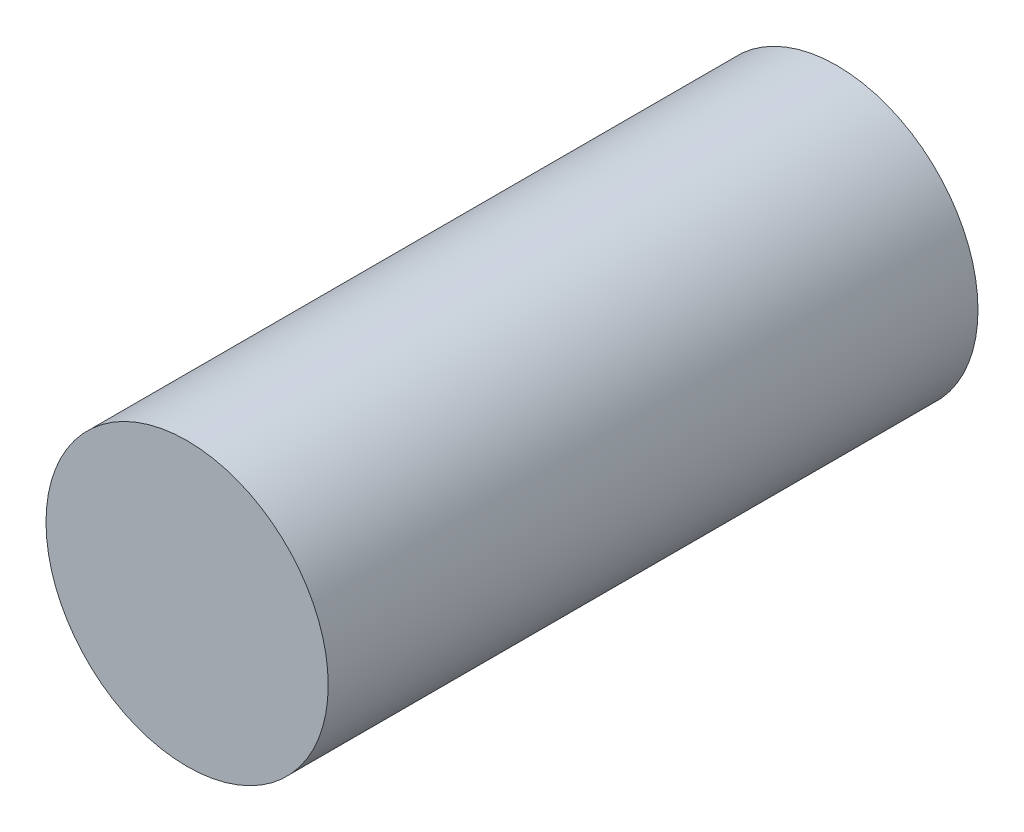
ISO-10303-21;
HEADER;
FILE_DESCRIPTION(('STEP AP214'),'2;1');
FILE_NAME('part.step','',(''),(''),'','','');
FILE_SCHEMA(('AUTOMOTIVE_DESIGN { 1 0 10303 214 1 1 1 1 }'));
ENDSEC;
DATA;
#1=APPLICATION_CONTEXT('core data for automotive mechanical design processes');
#2=APPLICATION_PROTOCOL_DEFINITION('international standard','automotive_design',2000,#1);
#3=PRODUCT_CONTEXT('',#1,'mechanical');
#4=PRODUCT('Part','Part','',(#3));
#5=PRODUCT_RELATED_PRODUCT_CATEGORY('part','',(#4));
#6=PRODUCT_DEFINITION_FORMATION('','',#4);
#7=PRODUCT_DEFINITION_CONTEXT('part definition',#1,'design');
#8=PRODUCT_DEFINITION('design','',#6,#7);
#9=PRODUCT_DEFINITION_SHAPE('','',#8);
#10=(LENGTH_UNIT() NAMED_UNIT(*) SI_UNIT(.MILLI.,.METRE.));
#11=(NAMED_UNIT(*) PLANE_ANGLE_UNIT() SI_UNIT($,.RADIAN.));
#12=(NAMED_UNIT(*) SI_UNIT($,.STERADIAN.) SOLID_ANGLE_UNIT());
#13=UNCERTAINTY_MEASURE_WITH_UNIT(LENGTH_MEASURE(1.E-05),#10,'distance_accuracy_value','');
#14=(GEOMETRIC_REPRESENTATION_CONTEXT(3) GLOBAL_UNCERTAINTY_ASSIGNED_CONTEXT((#13)) GLOBAL_UNIT_ASSIGNED_CONTEXT((#10,
#11,#12)) REPRESENTATION_CONTEXT('',''));
#15=CARTESIAN_POINT('',(0.,0.,0.));
#16=DIRECTION('',(0.,0.,1.));
#17=DIRECTION('',(1.,0.,0.));
#18=AXIS2_PLACEMENT_3D('',#15,#16,#17);
#19=CARTESIAN_POINT('',(0.,0.,70.));
#20=DIRECTION('',(0.,0.,-1.));
#21=DIRECTION('',(-1.,0.,0.));
#22=AXIS2_PLACEMENT_3D('',#19,#20,#21);
#23=CYLINDRICAL_SURFACE('',#22,15.2);
#24=CARTESIAN_POINT('',(0.,0.,70.));
#25=DIRECTION('',(0.,0.,1.));
#26=DIRECTION('',(1.,0.,0.));
#27=AXIS2_PLACEMENT_3D('',#24,#25,#26);
#28=CIRCLE('',#27,15.2);
#29=CARTESIAN_POINT('',(15.2,0.,70.));
#30=VERTEX_POINT('',#29);
#31=EDGE_CURVE('E10',#30,#30,#28,.T.);
#32=ORIENTED_EDGE('',*,*,#31,.F.);
#33=EDGE_LOOP('',(#32));
#34=FACE_BOUND('',#33,.T.);
#35=CARTESIAN_POINT('',(0.,0.,0.));
#36=DIRECTION('',(0.,0.,1.));
#37=DIRECTION('',(1.,0.,0.));
#38=AXIS2_PLACEMENT_3D('',#35,#36,#37);
#39=CIRCLE('',#38,15.2);
#40=CARTESIAN_POINT('',(15.2,0.,0.));
#41=VERTEX_POINT('',#40);
#42=EDGE_CURVE('E34',#41,#41,#39,.T.);
#43=ORIENTED_EDGE('',*,*,#42,.T.);
#44=EDGE_LOOP('',(#43));
#45=FACE_BOUND('',#44,.T.);
#46=ADVANCED_FACE('F31',(#34,#45),#23,.T.);
#47=CARTESIAN_POINT('',(0.,0.,70.));
#48=DIRECTION('',(0.,0.,1.));
#49=DIRECTION('',(1.,0.,0.));
#50=AXIS2_PLACEMENT_3D('',#47,#48,#49);
#51=PLANE('',#50);
#52=ORIENTED_EDGE('',*,*,#31,.T.);
#53=EDGE_LOOP('',(#52));
#54=FACE_BOUND('',#53,.T.);
#55=ADVANCED_FACE('F46',(#54),#51,.T.);
#56=CARTESIAN_POINT('',(0.,0.,0.));
#57=DIRECTION('',(0.,0.,1.));
#58=DIRECTION('',(1.,0.,0.));
#59=AXIS2_PLACEMENT_3D('',#56,#57,#58);
#60=PLANE('',#59);
#61=ORIENTED_EDGE('',*,*,#42,.F.);
#62=EDGE_LOOP('',(#61));
#63=FACE_BOUND('',#62,.T.);
#64=ADVANCED_FACE('F44',(#63),#60,.F.);
#65=CLOSED_SHELL('',(#46,#55,#64));
#66=MANIFOLD_SOLID_BREP('B2',#65);
#67=ADVANCED_BREP_SHAPE_REPRESENTATION('',(#18,#66),#14);
#68=SHAPE_DEFINITION_REPRESENTATION(#9,#67);
ENDSEC;
END-ISO-10303-21;
